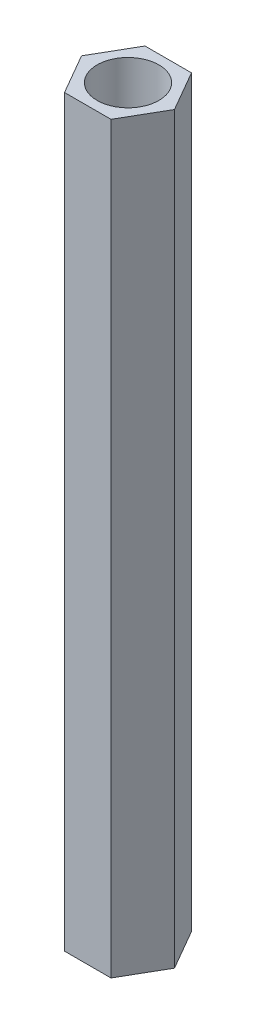
ISO-10303-21;
HEADER;
FILE_DESCRIPTION(('STEP AP214'),'2;1');
FILE_NAME('part.step','',(''),(''),'','','');
FILE_SCHEMA(('AUTOMOTIVE_DESIGN { 1 0 10303 214 1 1 1 1 }'));
ENDSEC;
DATA;
#1=APPLICATION_CONTEXT('core data for automotive mechanical design processes');
#2=APPLICATION_PROTOCOL_DEFINITION('international standard','automotive_design',2000,#1);
#3=PRODUCT_CONTEXT('',#1,'mechanical');
#4=PRODUCT('Part','Part','',(#3));
#5=PRODUCT_RELATED_PRODUCT_CATEGORY('part','',(#4));
#6=PRODUCT_DEFINITION_FORMATION('','',#4);
#7=PRODUCT_DEFINITION_CONTEXT('part definition',#1,'design');
#8=PRODUCT_DEFINITION('design','',#6,#7);
#9=PRODUCT_DEFINITION_SHAPE('','',#8);
#10=(LENGTH_UNIT() NAMED_UNIT(*) SI_UNIT(.MILLI.,.METRE.));
#11=(NAMED_UNIT(*) PLANE_ANGLE_UNIT() SI_UNIT($,.RADIAN.));
#12=(NAMED_UNIT(*) SI_UNIT($,.STERADIAN.) SOLID_ANGLE_UNIT());
#13=UNCERTAINTY_MEASURE_WITH_UNIT(LENGTH_MEASURE(1.E-05),#10,'distance_accuracy_value','');
#14=(GEOMETRIC_REPRESENTATION_CONTEXT(3) GLOBAL_UNCERTAINTY_ASSIGNED_CONTEXT((#13)) GLOBAL_UNIT_ASSIGNED_CONTEXT((#10,
#11,#12)) REPRESENTATION_CONTEXT('',''));
#15=CARTESIAN_POINT('',(0.,0.,0.));
#16=DIRECTION('',(0.,0.,1.));
#17=DIRECTION('',(1.,0.,0.));
#18=AXIS2_PLACEMENT_3D('',#15,#16,#17);
#19=CARTESIAN_POINT('',(1.25000000000002,40.,2.16506350946108));
#20=DIRECTION('',(-0.866025403784441,0.,-0.499999999999995));
#21=DIRECTION('',(-0.499999999999995,0.,0.866025403784441));
#22=AXIS2_PLACEMENT_3D('',#19,#20,#21);
#23=PLANE('',#22);
#24=DIRECTION('',(0.499999999999995,0.,-0.866025403784441));
#25=VECTOR('',#24,1.);
#26=CARTESIAN_POINT('',(1.25000000000002,0.,2.16506350946108));
#27=LINE('',#26,#25);
#28=CARTESIAN_POINT('',(1.25000000000002,0.,2.16506350946108));
#29=VERTEX_POINT('',#28);
#30=CARTESIAN_POINT('',(2.5,0.,0.));
#31=VERTEX_POINT('',#30);
#32=EDGE_CURVE('E117',#29,#31,#27,.T.);
#33=ORIENTED_EDGE('',*,*,#32,.T.);
#34=DIRECTION('',(0.,-1.,0.));
#35=VECTOR('',#34,1.);
#36=CARTESIAN_POINT('',(2.5,40.,0.));
#37=LINE('',#36,#35);
#38=CARTESIAN_POINT('',(2.5,40.,0.));
#39=VERTEX_POINT('',#38);
#40=EDGE_CURVE('E11',#39,#31,#37,.T.);
#41=ORIENTED_EDGE('',*,*,#40,.F.);
#42=DIRECTION('',(0.499999999999995,0.,-0.866025403784441));
#43=VECTOR('',#42,1.);
#44=CARTESIAN_POINT('',(1.25000000000002,40.,2.16506350946108));
#45=LINE('',#44,#43);
#46=CARTESIAN_POINT('',(1.25000000000002,40.,2.16506350946108));
#47=VERTEX_POINT('',#46);
#48=EDGE_CURVE('E128',#47,#39,#45,.T.);
#49=ORIENTED_EDGE('',*,*,#48,.F.);
#50=DIRECTION('',(0.,-1.,0.));
#51=VECTOR('',#50,1.);
#52=CARTESIAN_POINT('',(1.25000000000002,40.,2.16506350946108));
#53=LINE('',#52,#51);
#54=EDGE_CURVE('E113',#47,#29,#53,.T.);
#55=ORIENTED_EDGE('',*,*,#54,.T.);
#56=EDGE_LOOP('',(#33,#41,#49,#55));
#57=FACE_BOUND('',#56,.T.);
#58=ADVANCED_FACE('F33',(#57),#23,.F.);
#59=CARTESIAN_POINT('',(2.5,40.,0.));
#60=DIRECTION('',(-0.866025403784438,0.,0.500000000000001));
#61=DIRECTION('',(0.500000000000001,0.,0.866025403784438));
#62=AXIS2_PLACEMENT_3D('',#59,#60,#61);
#63=PLANE('',#62);
#64=DIRECTION('',(-0.500000000000001,0.,-0.866025403784438));
#65=VECTOR('',#64,1.);
#66=CARTESIAN_POINT('',(2.5,0.,0.));
#67=LINE('',#66,#65);
#68=CARTESIAN_POINT('',(1.24999999999999,0.,-2.1650635094611));
#69=VERTEX_POINT('',#68);
#70=EDGE_CURVE('E120',#31,#69,#67,.T.);
#71=ORIENTED_EDGE('',*,*,#70,.T.);
#72=DIRECTION('',(0.,-1.,0.));
#73=VECTOR('',#72,1.);
#74=CARTESIAN_POINT('',(1.24999999999999,40.,-2.1650635094611));
#75=LINE('',#74,#73);
#76=CARTESIAN_POINT('',(1.24999999999999,40.,-2.1650635094611));
#77=VERTEX_POINT('',#76);
#78=EDGE_CURVE('E41',#77,#69,#75,.T.);
#79=ORIENTED_EDGE('',*,*,#78,.F.);
#80=DIRECTION('',(-0.500000000000001,0.,-0.866025403784438));
#81=VECTOR('',#80,1.);
#82=CARTESIAN_POINT('',(2.5,40.,0.));
#83=LINE('',#82,#81);
#84=EDGE_CURVE('E86',#39,#77,#83,.T.);
#85=ORIENTED_EDGE('',*,*,#84,.F.);
#86=ORIENTED_EDGE('',*,*,#40,.T.);
#87=EDGE_LOOP('',(#71,#79,#85,#86));
#88=FACE_BOUND('',#87,.T.);
#89=ADVANCED_FACE('F153',(#88),#63,.F.);
#90=CARTESIAN_POINT('',(1.24999999999999,40.,-2.1650635094611));
#91=DIRECTION('',(0.,0.,1.));
#92=DIRECTION('',(1.,0.,0.));
#93=AXIS2_PLACEMENT_3D('',#90,#91,#92);
#94=PLANE('',#93);
#95=DIRECTION('',(-1.,0.,0.));
#96=VECTOR('',#95,1.);
#97=CARTESIAN_POINT('',(1.24999999999999,0.,-2.1650635094611));
#98=LINE('',#97,#96);
#99=CARTESIAN_POINT('',(-1.25000000000001,0.,-2.16506350946109));
#100=VERTEX_POINT('',#99);
#101=EDGE_CURVE('E123',#69,#100,#98,.T.);
#102=ORIENTED_EDGE('',*,*,#101,.T.);
#103=DIRECTION('',(0.,-1.,0.));
#104=VECTOR('',#103,1.);
#105=CARTESIAN_POINT('',(-1.25000000000001,40.,-2.16506350946109));
#106=LINE('',#105,#104);
#107=CARTESIAN_POINT('',(-1.25000000000001,40.,-2.16506350946109));
#108=VERTEX_POINT('',#107);
#109=EDGE_CURVE('E108',#108,#100,#106,.T.);
#110=ORIENTED_EDGE('',*,*,#109,.F.);
#111=DIRECTION('',(-1.,0.,0.));
#112=VECTOR('',#111,1.);
#113=CARTESIAN_POINT('',(1.24999999999999,40.,-2.1650635094611));
#114=LINE('',#113,#112);
#115=EDGE_CURVE('E99',#77,#108,#114,.T.);
#116=ORIENTED_EDGE('',*,*,#115,.F.);
#117=ORIENTED_EDGE('',*,*,#78,.T.);
#118=EDGE_LOOP('',(#102,#110,#116,#117));
#119=FACE_BOUND('',#118,.T.);
#120=ADVANCED_FACE('F134',(#119),#94,.F.);
#121=CARTESIAN_POINT('',(-1.25000000000001,40.,-2.16506350946109));
#122=DIRECTION('',(0.866025403784442,0.,0.499999999999995));
#123=DIRECTION('',(0.499999999999995,0.,-0.866025403784442));
#124=AXIS2_PLACEMENT_3D('',#121,#122,#123);
#125=PLANE('',#124);
#126=DIRECTION('',(-0.499999999999995,0.,0.866025403784442));
#127=VECTOR('',#126,1.);
#128=CARTESIAN_POINT('',(-1.25000000000001,0.,-2.16506350946109));
#129=LINE('',#128,#127);
#130=CARTESIAN_POINT('',(-2.5,0.,0.));
#131=VERTEX_POINT('',#130);
#132=EDGE_CURVE('E107',#100,#131,#129,.T.);
#133=ORIENTED_EDGE('',*,*,#132,.T.);
#134=DIRECTION('',(0.,-1.,0.));
#135=VECTOR('',#134,1.);
#136=CARTESIAN_POINT('',(-2.5,40.,0.));
#137=LINE('',#136,#135);
#138=CARTESIAN_POINT('',(-2.5,40.,0.));
#139=VERTEX_POINT('',#138);
#140=EDGE_CURVE('E104',#139,#131,#137,.T.);
#141=ORIENTED_EDGE('',*,*,#140,.F.);
#142=DIRECTION('',(-0.499999999999995,0.,0.866025403784442));
#143=VECTOR('',#142,1.);
#144=CARTESIAN_POINT('',(-1.25000000000001,40.,-2.16506350946109));
#145=LINE('',#144,#143);
#146=EDGE_CURVE('E93',#108,#139,#145,.T.);
#147=ORIENTED_EDGE('',*,*,#146,.F.);
#148=ORIENTED_EDGE('',*,*,#109,.T.);
#149=EDGE_LOOP('',(#133,#141,#147,#148));
#150=FACE_BOUND('',#149,.T.);
#151=ADVANCED_FACE('F105',(#150),#125,.F.);
#152=CARTESIAN_POINT('',(-2.5,40.,0.));
#153=DIRECTION('',(0.866025403784434,0.,-0.500000000000007));
#154=DIRECTION('',(-0.500000000000007,0.,-0.866025403784435));
#155=AXIS2_PLACEMENT_3D('',#152,#153,#154);
#156=PLANE('',#155);
#157=DIRECTION('',(0.500000000000007,0.,0.866025403784434));
#158=VECTOR('',#157,1.);
#159=CARTESIAN_POINT('',(-2.5,0.,0.));
#160=LINE('',#159,#158);
#161=CARTESIAN_POINT('',(-1.24999999999998,0.,2.1650635094611));
#162=VERTEX_POINT('',#161);
#163=EDGE_CURVE('E72',#131,#162,#160,.T.);
#164=ORIENTED_EDGE('',*,*,#163,.T.);
#165=DIRECTION('',(0.,-1.,0.));
#166=VECTOR('',#165,1.);
#167=CARTESIAN_POINT('',(-1.24999999999998,40.,2.1650635094611));
#168=LINE('',#167,#166);
#169=CARTESIAN_POINT('',(-1.24999999999998,40.,2.1650635094611));
#170=VERTEX_POINT('',#169);
#171=EDGE_CURVE('E109',#170,#162,#168,.T.);
#172=ORIENTED_EDGE('',*,*,#171,.F.);
#173=DIRECTION('',(0.500000000000007,0.,0.866025403784434));
#174=VECTOR('',#173,1.);
#175=CARTESIAN_POINT('',(-2.5,40.,0.));
#176=LINE('',#175,#174);
#177=EDGE_CURVE('E97',#139,#170,#176,.T.);
#178=ORIENTED_EDGE('',*,*,#177,.F.);
#179=ORIENTED_EDGE('',*,*,#140,.T.);
#180=EDGE_LOOP('',(#164,#172,#178,#179));
#181=FACE_BOUND('',#180,.T.);
#182=ADVANCED_FACE('F111',(#181),#156,.F.);
#183=CARTESIAN_POINT('',(-1.24999999999998,40.,2.1650635094611));
#184=DIRECTION('',(0.,0.,-1.));
#185=DIRECTION('',(-1.,0.,0.));
#186=AXIS2_PLACEMENT_3D('',#183,#184,#185);
#187=PLANE('',#186);
#188=DIRECTION('',(1.,0.,0.));
#189=VECTOR('',#188,1.);
#190=CARTESIAN_POINT('',(-1.24999999999998,0.,2.1650635094611));
#191=LINE('',#190,#189);
#192=EDGE_CURVE('E78',#162,#29,#191,.T.);
#193=ORIENTED_EDGE('',*,*,#192,.T.);
#194=ORIENTED_EDGE('',*,*,#54,.F.);
#195=DIRECTION('',(1.,0.,0.));
#196=VECTOR('',#195,1.);
#197=CARTESIAN_POINT('',(-1.24999999999998,40.,2.1650635094611));
#198=LINE('',#197,#196);
#199=EDGE_CURVE('E49',#170,#47,#198,.T.);
#200=ORIENTED_EDGE('',*,*,#199,.F.);
#201=ORIENTED_EDGE('',*,*,#171,.T.);
#202=EDGE_LOOP('',(#193,#194,#200,#201));
#203=FACE_BOUND('',#202,.T.);
#204=ADVANCED_FACE('F141',(#203),#187,.F.);
#205=CARTESIAN_POINT('',(0.,40.,0.));
#206=DIRECTION('',(0.,1.,0.));
#207=DIRECTION('',(0.,0.,1.));
#208=AXIS2_PLACEMENT_3D('',#205,#206,#207);
#209=PLANE('',#208);
#210=CARTESIAN_POINT('',(0.,40.,0.));
#211=DIRECTION('',(0.,1.,0.));
#212=DIRECTION('',(0.,0.,1.));
#213=AXIS2_PLACEMENT_3D('',#210,#211,#212);
#214=CIRCLE('',#213,1.6603858136733);
#215=CARTESIAN_POINT('',(0.,40.,1.6603858136733));
#216=VERTEX_POINT('',#215);
#217=EDGE_CURVE('E208',#216,#216,#214,.T.);
#218=ORIENTED_EDGE('',*,*,#217,.F.);
#219=EDGE_LOOP('',(#218));
#220=FACE_BOUND('',#219,.T.);
#221=ORIENTED_EDGE('',*,*,#48,.T.);
#222=ORIENTED_EDGE('',*,*,#84,.T.);
#223=ORIENTED_EDGE('',*,*,#115,.T.);
#224=ORIENTED_EDGE('',*,*,#146,.T.);
#225=ORIENTED_EDGE('',*,*,#177,.T.);
#226=ORIENTED_EDGE('',*,*,#199,.T.);
#227=EDGE_LOOP('',(#221,#222,#223,#224,#225,#226));
#228=FACE_BOUND('',#227,.T.);
#229=ADVANCED_FACE('F95',(#220,#228),#209,.T.);
#230=CARTESIAN_POINT('',(0.,0.,0.));
#231=DIRECTION('',(0.,1.,0.));
#232=DIRECTION('',(0.,0.,1.));
#233=AXIS2_PLACEMENT_3D('',#230,#231,#232);
#234=PLANE('',#233);
#235=CARTESIAN_POINT('',(0.,0.,0.));
#236=DIRECTION('',(0.,1.,0.));
#237=DIRECTION('',(0.,0.,1.));
#238=AXIS2_PLACEMENT_3D('',#235,#236,#237);
#239=CIRCLE('',#238,1.6603858136733);
#240=CARTESIAN_POINT('',(0.,0.,1.6603858136733));
#241=VERTEX_POINT('',#240);
#242=EDGE_CURVE('E121',#241,#241,#239,.T.);
#243=ORIENTED_EDGE('',*,*,#242,.T.);
#244=EDGE_LOOP('',(#243));
#245=FACE_BOUND('',#244,.T.);
#246=ORIENTED_EDGE('',*,*,#32,.F.);
#247=ORIENTED_EDGE('',*,*,#192,.F.);
#248=ORIENTED_EDGE('',*,*,#163,.F.);
#249=ORIENTED_EDGE('',*,*,#132,.F.);
#250=ORIENTED_EDGE('',*,*,#101,.F.);
#251=ORIENTED_EDGE('',*,*,#70,.F.);
#252=EDGE_LOOP('',(#246,#247,#248,#249,#250,#251));
#253=FACE_BOUND('',#252,.T.);
#254=ADVANCED_FACE('F137',(#245,#253),#234,.F.);
#255=CARTESIAN_POINT('',(0.,0.,0.));
#256=DIRECTION('',(0.,1.,0.));
#257=DIRECTION('',(0.,0.,1.));
#258=AXIS2_PLACEMENT_3D('',#255,#256,#257);
#259=CYLINDRICAL_SURFACE('',#258,1.6603858136733);
#260=ORIENTED_EDGE('',*,*,#242,.F.);
#261=EDGE_LOOP('',(#260));
#262=FACE_BOUND('',#261,.T.);
#263=ORIENTED_EDGE('',*,*,#217,.T.);
#264=EDGE_LOOP('',(#263));
#265=FACE_BOUND('',#264,.T.);
#266=ADVANCED_FACE('F190',(#262,#265),#259,.F.);
#267=CLOSED_SHELL('',(#58,#89,#120,#151,#182,#204,#229,#254,#266));
#268=MANIFOLD_SOLID_BREP('B2',#267);
#269=ADVANCED_BREP_SHAPE_REPRESENTATION('',(#18,#268),#14);
#270=SHAPE_DEFINITION_REPRESENTATION(#9,#269);
ENDSEC;
END-ISO-10303-21;
